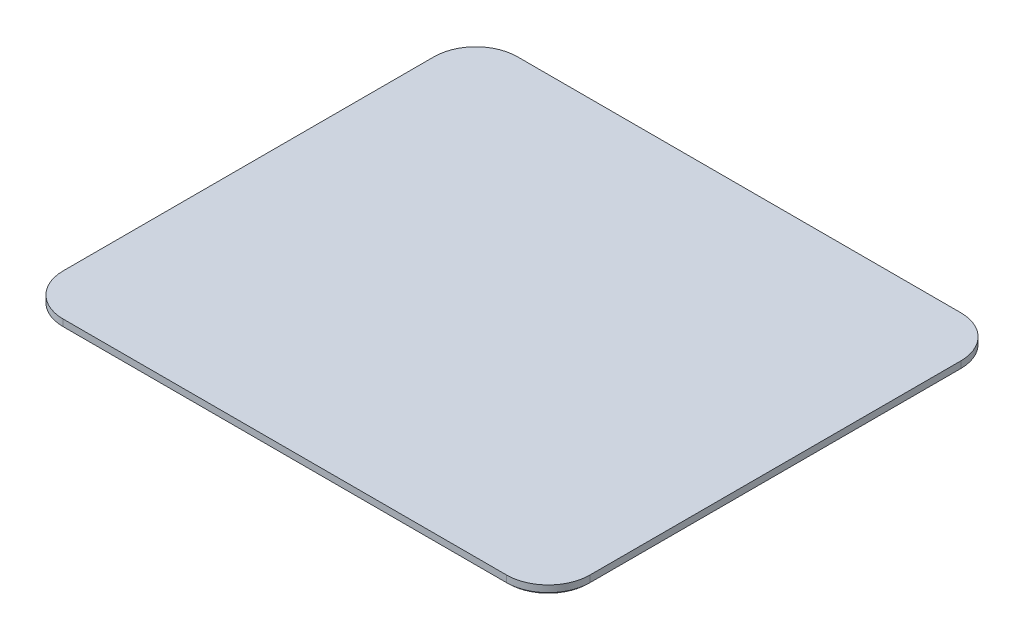
ISO-10303-21;
HEADER;
FILE_DESCRIPTION(('STEP AP214'),'2;1');
FILE_NAME('part.step','',(''),(''),'','','');
FILE_SCHEMA(('AUTOMOTIVE_DESIGN { 1 0 10303 214 1 1 1 1 }'));
ENDSEC;
DATA;
#1=APPLICATION_CONTEXT('core data for automotive mechanical design processes');
#2=APPLICATION_PROTOCOL_DEFINITION('international standard','automotive_design',2000,#1);
#3=PRODUCT_CONTEXT('',#1,'mechanical');
#4=PRODUCT('Part','Part','',(#3));
#5=PRODUCT_RELATED_PRODUCT_CATEGORY('part','',(#4));
#6=PRODUCT_DEFINITION_FORMATION('','',#4);
#7=PRODUCT_DEFINITION_CONTEXT('part definition',#1,'design');
#8=PRODUCT_DEFINITION('design','',#6,#7);
#9=PRODUCT_DEFINITION_SHAPE('','',#8);
#10=(LENGTH_UNIT() NAMED_UNIT(*) SI_UNIT(.MILLI.,.METRE.));
#11=(NAMED_UNIT(*) PLANE_ANGLE_UNIT() SI_UNIT($,.RADIAN.));
#12=(NAMED_UNIT(*) SI_UNIT($,.STERADIAN.) SOLID_ANGLE_UNIT());
#13=UNCERTAINTY_MEASURE_WITH_UNIT(LENGTH_MEASURE(1.E-05),#10,'distance_accuracy_value','');
#14=(GEOMETRIC_REPRESENTATION_CONTEXT(3) GLOBAL_UNCERTAINTY_ASSIGNED_CONTEXT((#13)) GLOBAL_UNIT_ASSIGNED_CONTEXT((#10,
#11,#12)) REPRESENTATION_CONTEXT('',''));
#15=CARTESIAN_POINT('',(0.,0.,0.));
#16=DIRECTION('',(0.,0.,1.));
#17=DIRECTION('',(1.,0.,0.));
#18=AXIS2_PLACEMENT_3D('',#15,#16,#17);
#19=CARTESIAN_POINT('',(-266.,-5.,222.5));
#20=DIRECTION('',(0.,1.,0.));
#21=DIRECTION('',(0.,0.,1.));
#22=AXIS2_PLACEMENT_3D('',#19,#20,#21);
#23=PLANE('',#22);
#24=DIRECTION('',(1.,0.,0.));
#25=VECTOR('',#24,1.);
#26=CARTESIAN_POINT('',(-266.,-5.,-262.5));
#27=LINE('',#26,#25);
#28=CARTESIAN_POINT('',(-100.,-5.,-262.5));
#29=VERTEX_POINT('',#28);
#30=CARTESIAN_POINT('',(100.,-5.,-262.5));
#31=VERTEX_POINT('',#30);
#32=EDGE_CURVE('E11',#29,#31,#27,.T.);
#33=ORIENTED_EDGE('',*,*,#32,.T.);
#34=DIRECTION('',(0.,0.,-1.));
#35=VECTOR('',#34,1.);
#36=CARTESIAN_POINT('',(100.,-5.,222.5));
#37=LINE('',#36,#35);
#38=CARTESIAN_POINT('',(100.,-4.99999999999997,-270.5));
#39=VERTEX_POINT('',#38);
#40=EDGE_CURVE('E288',#31,#39,#37,.T.);
#41=ORIENTED_EDGE('',*,*,#40,.T.);
#42=DIRECTION('',(1.,0.,0.));
#43=VECTOR('',#42,1.);
#44=CARTESIAN_POINT('',(-266.,-5.,-270.5));
#45=LINE('',#44,#43);
#46=CARTESIAN_POINT('',(266.,-5.,-270.5));
#47=VERTEX_POINT('',#46);
#48=EDGE_CURVE('E345',#39,#47,#45,.T.);
#49=ORIENTED_EDGE('',*,*,#48,.T.);
#50=CARTESIAN_POINT('',(266.,-5.,-222.5));
#51=DIRECTION('',(0.,1.,0.));
#52=DIRECTION('',(0.,0.,1.));
#53=AXIS2_PLACEMENT_3D('',#50,#51,#52);
#54=CIRCLE('',#53,48.);
#55=CARTESIAN_POINT('',(314.,-5.,-222.5));
#56=VERTEX_POINT('',#55);
#57=EDGE_CURVE('E349',#47,#56,#54,.F.);
#58=ORIENTED_EDGE('',*,*,#57,.T.);
#59=DIRECTION('',(0.,0.,1.));
#60=VECTOR('',#59,1.);
#61=CARTESIAN_POINT('',(314.,-5.,222.5));
#62=LINE('',#61,#60);
#63=CARTESIAN_POINT('',(314.,-5.,222.5));
#64=VERTEX_POINT('',#63);
#65=EDGE_CURVE('E351',#56,#64,#62,.T.);
#66=ORIENTED_EDGE('',*,*,#65,.T.);
#67=CARTESIAN_POINT('',(266.,-5.,222.5));
#68=DIRECTION('',(0.,1.,0.));
#69=DIRECTION('',(0.,0.,1.));
#70=AXIS2_PLACEMENT_3D('',#67,#68,#69);
#71=CIRCLE('',#70,48.);
#72=CARTESIAN_POINT('',(266.,-5.,270.5));
#73=VERTEX_POINT('',#72);
#74=EDGE_CURVE('E353',#64,#73,#71,.F.);
#75=ORIENTED_EDGE('',*,*,#74,.T.);
#76=DIRECTION('',(-1.,0.,0.));
#77=VECTOR('',#76,1.);
#78=CARTESIAN_POINT('',(-266.,-5.,270.5));
#79=LINE('',#78,#77);
#80=CARTESIAN_POINT('',(-266.,-5.,270.5));
#81=VERTEX_POINT('',#80);
#82=EDGE_CURVE('E337',#73,#81,#79,.T.);
#83=ORIENTED_EDGE('',*,*,#82,.T.);
#84=CARTESIAN_POINT('',(-266.,-5.,222.5));
#85=DIRECTION('',(0.,1.,0.));
#86=DIRECTION('',(0.,0.,1.));
#87=AXIS2_PLACEMENT_3D('',#84,#85,#86);
#88=CIRCLE('',#87,48.);
#89=CARTESIAN_POINT('',(-314.,-5.,222.5));
#90=VERTEX_POINT('',#89);
#91=EDGE_CURVE('E339',#81,#90,#88,.F.);
#92=ORIENTED_EDGE('',*,*,#91,.T.);
#93=DIRECTION('',(0.,0.,-1.));
#94=VECTOR('',#93,1.);
#95=CARTESIAN_POINT('',(-314.,-5.,222.5));
#96=LINE('',#95,#94);
#97=CARTESIAN_POINT('',(-314.,-5.,-222.5));
#98=VERTEX_POINT('',#97);
#99=EDGE_CURVE('E341',#90,#98,#96,.T.);
#100=ORIENTED_EDGE('',*,*,#99,.T.);
#101=CARTESIAN_POINT('',(-266.,-5.,-222.5));
#102=DIRECTION('',(0.,1.,0.));
#103=DIRECTION('',(0.,0.,1.));
#104=AXIS2_PLACEMENT_3D('',#101,#102,#103);
#105=CIRCLE('',#104,48.);
#106=CARTESIAN_POINT('',(-266.,-5.,-270.5));
#107=VERTEX_POINT('',#106);
#108=EDGE_CURVE('E343',#98,#107,#105,.F.);
#109=ORIENTED_EDGE('',*,*,#108,.T.);
#110=CARTESIAN_POINT('',(-100.,-4.99999999999997,-270.5));
#111=VERTEX_POINT('',#110);
#112=EDGE_CURVE('E346',#107,#111,#45,.T.);
#113=ORIENTED_EDGE('',*,*,#112,.T.);
#114=DIRECTION('',(0.,0.,1.));
#115=VECTOR('',#114,1.);
#116=CARTESIAN_POINT('',(-100.,-5.,222.5));
#117=LINE('',#116,#115);
#118=EDGE_CURVE('E280',#111,#29,#117,.T.);
#119=ORIENTED_EDGE('',*,*,#118,.T.);
#120=EDGE_LOOP('',(#33,#41,#49,#58,#66,#75,#83,#92,#100,#109,#113,#119));
#121=FACE_BOUND('',#120,.T.);
#122=CARTESIAN_POINT('',(-200.,-5.,150.));
#123=DIRECTION('',(0.,-1.,0.));
#124=DIRECTION('',(0.,0.,-1.));
#125=AXIS2_PLACEMENT_3D('',#122,#123,#124);
#126=CIRCLE('',#125,50.);
#127=CARTESIAN_POINT('',(-200.,-5.,200.));
#128=VERTEX_POINT('',#127);
#129=CARTESIAN_POINT('',(-250.,-5.,150.));
#130=VERTEX_POINT('',#129);
#131=EDGE_CURVE('E239',#128,#130,#126,.T.);
#132=ORIENTED_EDGE('',*,*,#131,.F.);
#133=DIRECTION('',(-1.,0.,0.));
#134=VECTOR('',#133,1.);
#135=CARTESIAN_POINT('',(-200.,-5.,200.));
#136=LINE('',#135,#134);
#137=CARTESIAN_POINT('',(200.,-5.,200.));
#138=VERTEX_POINT('',#137);
#139=EDGE_CURVE('E236',#138,#128,#136,.T.);
#140=ORIENTED_EDGE('',*,*,#139,.F.);
#141=CARTESIAN_POINT('',(200.,-5.,150.));
#142=DIRECTION('',(0.,-1.,0.));
#143=DIRECTION('',(0.,0.,-1.));
#144=AXIS2_PLACEMENT_3D('',#141,#142,#143);
#145=CIRCLE('',#144,50.);
#146=CARTESIAN_POINT('',(250.,-5.,150.));
#147=VERTEX_POINT('',#146);
#148=EDGE_CURVE('E783',#147,#138,#145,.T.);
#149=ORIENTED_EDGE('',*,*,#148,.F.);
#150=DIRECTION('',(0.,0.,1.));
#151=VECTOR('',#150,1.);
#152=CARTESIAN_POINT('',(250.,-5.,150.));
#153=LINE('',#152,#151);
#154=CARTESIAN_POINT('',(250.,-5.,-150.));
#155=VERTEX_POINT('',#154);
#156=EDGE_CURVE('E814',#155,#147,#153,.T.);
#157=ORIENTED_EDGE('',*,*,#156,.F.);
#158=CARTESIAN_POINT('',(200.,-5.,-150.));
#159=DIRECTION('',(0.,-1.,0.));
#160=DIRECTION('',(0.,0.,-1.));
#161=AXIS2_PLACEMENT_3D('',#158,#159,#160);
#162=CIRCLE('',#161,50.);
#163=CARTESIAN_POINT('',(200.,-5.,-200.));
#164=VERTEX_POINT('',#163);
#165=EDGE_CURVE('E807',#164,#155,#162,.T.);
#166=ORIENTED_EDGE('',*,*,#165,.F.);
#167=DIRECTION('',(1.,0.,0.));
#168=VECTOR('',#167,1.);
#169=CARTESIAN_POINT('',(-200.,-5.,-200.));
#170=LINE('',#169,#168);
#171=CARTESIAN_POINT('',(-200.,-5.,-200.));
#172=VERTEX_POINT('',#171);
#173=EDGE_CURVE('E804',#172,#164,#170,.T.);
#174=ORIENTED_EDGE('',*,*,#173,.F.);
#175=CARTESIAN_POINT('',(-200.,-5.,-150.));
#176=DIRECTION('',(0.,-1.,0.));
#177=DIRECTION('',(0.,0.,-1.));
#178=AXIS2_PLACEMENT_3D('',#175,#176,#177);
#179=CIRCLE('',#178,50.);
#180=CARTESIAN_POINT('',(-250.,-5.,-150.));
#181=VERTEX_POINT('',#180);
#182=EDGE_CURVE('E60',#181,#172,#179,.T.);
#183=ORIENTED_EDGE('',*,*,#182,.F.);
#184=DIRECTION('',(0.,0.,-1.));
#185=VECTOR('',#184,1.);
#186=CARTESIAN_POINT('',(-250.,-5.,150.));
#187=LINE('',#186,#185);
#188=EDGE_CURVE('E55',#130,#181,#187,.T.);
#189=ORIENTED_EDGE('',*,*,#188,.F.);
#190=EDGE_LOOP('',(#132,#140,#149,#157,#166,#174,#183,#189));
#191=FACE_BOUND('',#190,.T.);
#192=ADVANCED_FACE('F39',(#121,#191),#23,.F.);
#193=CARTESIAN_POINT('',(100.,-15.,-262.5));
#194=DIRECTION('',(1.,0.,0.));
#195=DIRECTION('',(0.,0.,-1.));
#196=AXIS2_PLACEMENT_3D('',#193,#194,#195);
#197=PLANE('',#196);
#198=CARTESIAN_POINT('',(100.,-9.99688936101096,-267.5));
#199=DIRECTION('',(1.,0.,0.));
#200=DIRECTION('',(0.,0.,-1.));
#201=AXIS2_PLACEMENT_3D('',#198,#199,#200);
#202=CIRCLE('',#201,5.);
#203=CARTESIAN_POINT('',(100.,-14.996889361011,-267.5));
#204=VERTEX_POINT('',#203);
#205=CARTESIAN_POINT('',(100.,-9.99688936101096,-262.5));
#206=VERTEX_POINT('',#205);
#207=EDGE_CURVE('E257',#204,#206,#202,.F.);
#208=ORIENTED_EDGE('',*,*,#207,.F.);
#209=DIRECTION('',(0.,1.,0.));
#210=VECTOR('',#209,1.);
#211=CARTESIAN_POINT('',(100.,-15.,-267.5));
#212=LINE('',#211,#210);
#213=CARTESIAN_POINT('',(100.,-15.,-267.5));
#214=VERTEX_POINT('',#213);
#215=EDGE_CURVE('E259',#214,#204,#212,.T.);
#216=ORIENTED_EDGE('',*,*,#215,.F.);
#217=DIRECTION('',(0.,0.,-1.));
#218=VECTOR('',#217,1.);
#219=CARTESIAN_POINT('',(100.,-15.,-262.5));
#220=LINE('',#219,#218);
#221=CARTESIAN_POINT('',(100.,-15.,-272.5));
#222=VERTEX_POINT('',#221);
#223=EDGE_CURVE('E269',#214,#222,#220,.T.);
#224=ORIENTED_EDGE('',*,*,#223,.T.);
#225=DIRECTION('',(0.,1.,0.));
#226=VECTOR('',#225,1.);
#227=CARTESIAN_POINT('',(100.,-15.,-272.5));
#228=LINE('',#227,#226);
#229=CARTESIAN_POINT('',(100.,-3.,-272.5));
#230=VERTEX_POINT('',#229);
#231=EDGE_CURVE('E277',#222,#230,#228,.T.);
#232=ORIENTED_EDGE('',*,*,#231,.T.);
#233=DIRECTION('',(0.,0.707106781186548,-0.707106781186548));
#234=VECTOR('',#233,1.);
#235=CARTESIAN_POINT('',(100.,-3.,-272.5));
#236=LINE('',#235,#234);
#237=EDGE_CURVE('E48',#230,#39,#236,.F.);
#238=ORIENTED_EDGE('',*,*,#237,.T.);
#239=ORIENTED_EDGE('',*,*,#40,.F.);
#240=DIRECTION('',(0.,1.,0.));
#241=VECTOR('',#240,1.);
#242=CARTESIAN_POINT('',(100.,-15.,-262.5));
#243=LINE('',#242,#241);
#244=EDGE_CURVE('E278',#206,#31,#243,.T.);
#245=ORIENTED_EDGE('',*,*,#244,.F.);
#246=EDGE_LOOP('',(#208,#216,#224,#232,#238,#239,#245));
#247=FACE_BOUND('',#246,.T.);
#248=CARTESIAN_POINT('',(100.,-9.99688936101096,-267.5));
#249=DIRECTION('',(1.,0.,0.));
#250=DIRECTION('',(0.,0.,-1.));
#251=AXIS2_PLACEMENT_3D('',#248,#249,#250);
#252=CIRCLE('',#251,2.);
#253=CARTESIAN_POINT('',(100.,-9.99688936101096,-269.5));
#254=VERTEX_POINT('',#253);
#255=EDGE_CURVE('E243',#254,#254,#252,.T.);
#256=ORIENTED_EDGE('',*,*,#255,.F.);
#257=EDGE_LOOP('',(#256));
#258=FACE_BOUND('',#257,.T.);
#259=ADVANCED_FACE('F398',(#247,#258),#197,.T.);
#260=CARTESIAN_POINT('',(-100.,-15.,-272.5));
#261=DIRECTION('',(-1.,0.,0.));
#262=DIRECTION('',(0.,0.,1.));
#263=AXIS2_PLACEMENT_3D('',#260,#261,#262);
#264=PLANE('',#263);
#265=DIRECTION('',(0.,0.,1.));
#266=VECTOR('',#265,1.);
#267=CARTESIAN_POINT('',(-100.,-15.,-272.5));
#268=LINE('',#267,#266);
#269=CARTESIAN_POINT('',(-100.,-15.,-272.5));
#270=VERTEX_POINT('',#269);
#271=CARTESIAN_POINT('',(-100.,-15.,-267.5));
#272=VERTEX_POINT('',#271);
#273=EDGE_CURVE('E274',#270,#272,#268,.T.);
#274=ORIENTED_EDGE('',*,*,#273,.T.);
#275=DIRECTION('',(0.,1.,0.));
#276=VECTOR('',#275,1.);
#277=CARTESIAN_POINT('',(-100.,-15.,-267.5));
#278=LINE('',#277,#276);
#279=CARTESIAN_POINT('',(-100.,-14.996889361011,-267.5));
#280=VERTEX_POINT('',#279);
#281=EDGE_CURVE('E254',#272,#280,#278,.T.);
#282=ORIENTED_EDGE('',*,*,#281,.T.);
#283=CARTESIAN_POINT('',(-100.,-9.99688936101096,-267.5));
#284=DIRECTION('',(-1.,0.,0.));
#285=DIRECTION('',(0.,0.,1.));
#286=AXIS2_PLACEMENT_3D('',#283,#284,#285);
#287=CIRCLE('',#286,5.);
#288=CARTESIAN_POINT('',(-100.,-9.99688936101096,-262.5));
#289=VERTEX_POINT('',#288);
#290=EDGE_CURVE('E251',#280,#289,#287,.T.);
#291=ORIENTED_EDGE('',*,*,#290,.T.);
#292=DIRECTION('',(0.,1.,0.));
#293=VECTOR('',#292,1.);
#294=CARTESIAN_POINT('',(-100.,-15.,-262.5));
#295=LINE('',#294,#293);
#296=EDGE_CURVE('E281',#289,#29,#295,.T.);
#297=ORIENTED_EDGE('',*,*,#296,.T.);
#298=ORIENTED_EDGE('',*,*,#118,.F.);
#299=DIRECTION('',(0.,-0.707106781186548,0.707106781186548));
#300=VECTOR('',#299,1.);
#301=CARTESIAN_POINT('',(-100.,-3.,-272.5));
#302=LINE('',#301,#300);
#303=CARTESIAN_POINT('',(-100.,-3.,-272.5));
#304=VERTEX_POINT('',#303);
#305=EDGE_CURVE('E372',#111,#304,#302,.F.);
#306=ORIENTED_EDGE('',*,*,#305,.T.);
#307=DIRECTION('',(0.,1.,0.));
#308=VECTOR('',#307,1.);
#309=CARTESIAN_POINT('',(-100.,-15.,-272.5));
#310=LINE('',#309,#308);
#311=EDGE_CURVE('E283',#270,#304,#310,.T.);
#312=ORIENTED_EDGE('',*,*,#311,.F.);
#313=EDGE_LOOP('',(#274,#282,#291,#297,#298,#306,#312));
#314=FACE_BOUND('',#313,.T.);
#315=CARTESIAN_POINT('',(-100.,-9.99688936101096,-267.5));
#316=DIRECTION('',(-1.,0.,0.));
#317=DIRECTION('',(0.,0.,1.));
#318=AXIS2_PLACEMENT_3D('',#315,#316,#317);
#319=CIRCLE('',#318,2.);
#320=CARTESIAN_POINT('',(-100.,-9.99688936101096,-265.5));
#321=VERTEX_POINT('',#320);
#322=EDGE_CURVE('E240',#321,#321,#319,.F.);
#323=ORIENTED_EDGE('',*,*,#322,.T.);
#324=EDGE_LOOP('',(#323));
#325=FACE_BOUND('',#324,.T.);
#326=ADVANCED_FACE('F466',(#314,#325),#264,.T.);
#327=CARTESIAN_POINT('',(0.,-15.,0.));
#328=DIRECTION('',(0.,-1.,0.));
#329=DIRECTION('',(0.,0.,-1.));
#330=AXIS2_PLACEMENT_3D('',#327,#328,#329);
#331=PLANE('',#330);
#332=ORIENTED_EDGE('',*,*,#223,.F.);
#333=DIRECTION('',(-1.,0.,0.));
#334=VECTOR('',#333,1.);
#335=CARTESIAN_POINT('',(316.001,-15.,-267.5));
#336=LINE('',#335,#334);
#337=EDGE_CURVE('E266',#214,#272,#336,.T.);
#338=ORIENTED_EDGE('',*,*,#337,.T.);
#339=ORIENTED_EDGE('',*,*,#273,.F.);
#340=DIRECTION('',(-1.,0.,0.));
#341=VECTOR('',#340,1.);
#342=CARTESIAN_POINT('',(-100.,-15.,-272.5));
#343=LINE('',#342,#341);
#344=EDGE_CURVE('E271',#222,#270,#343,.T.);
#345=ORIENTED_EDGE('',*,*,#344,.F.);
#346=EDGE_LOOP('',(#332,#338,#339,#345));
#347=FACE_BOUND('',#346,.T.);
#348=ADVANCED_FACE('F481',(#347),#331,.T.);
#349=CARTESIAN_POINT('',(-266.,-3.,-272.5));
#350=DIRECTION('',(0.,0.707106781186547,0.707106781186547));
#351=DIRECTION('',(-1.,0.,0.));
#352=AXIS2_PLACEMENT_3D('',#349,#350,#351);
#353=PLANE('',#352);
#354=ORIENTED_EDGE('',*,*,#237,.F.);
#355=DIRECTION('',(-1.,0.,0.));
#356=VECTOR('',#355,1.);
#357=CARTESIAN_POINT('',(-266.,-3.,-272.5));
#358=LINE('',#357,#356);
#359=CARTESIAN_POINT('',(266.,-3.,-272.5));
#360=VERTEX_POINT('',#359);
#361=EDGE_CURVE('E361',#360,#230,#358,.T.);
#362=ORIENTED_EDGE('',*,*,#361,.F.);
#363=DIRECTION('',(0.,0.707106781186547,-0.707106781186547));
#364=VECTOR('',#363,1.);
#365=CARTESIAN_POINT('',(266.,-5.,-270.5));
#366=LINE('',#365,#364);
#367=EDGE_CURVE('E382',#47,#360,#366,.T.);
#368=ORIENTED_EDGE('',*,*,#367,.F.);
#369=ORIENTED_EDGE('',*,*,#48,.F.);
#370=EDGE_LOOP('',(#354,#362,#368,#369));
#371=FACE_BOUND('',#370,.T.);
#372=ADVANCED_FACE('F408',(#371),#353,.F.);
#373=CARTESIAN_POINT('',(-266.,5.,222.5));
#374=DIRECTION('',(0.,-1.,0.));
#375=DIRECTION('',(0.,0.,-1.));
#376=AXIS2_PLACEMENT_3D('',#373,#374,#375);
#377=CYLINDRICAL_SURFACE('',#376,50.);
#378=DIRECTION('',(0.,-1.,0.));
#379=VECTOR('',#378,1.);
#380=CARTESIAN_POINT('',(-316.,5.,222.5));
#381=LINE('',#380,#379);
#382=CARTESIAN_POINT('',(-316.,5.,222.5));
#383=VERTEX_POINT('',#382);
#384=CARTESIAN_POINT('',(-316.,-3.,222.5));
#385=VERTEX_POINT('',#384);
#386=EDGE_CURVE('E310',#383,#385,#381,.T.);
#387=ORIENTED_EDGE('',*,*,#386,.T.);
#388=CARTESIAN_POINT('',(-266.,-3.,222.5));
#389=DIRECTION('',(0.,1.,0.));
#390=DIRECTION('',(0.,0.,1.));
#391=AXIS2_PLACEMENT_3D('',#388,#389,#390);
#392=CIRCLE('',#391,50.);
#393=CARTESIAN_POINT('',(-266.,-3.,272.5));
#394=VERTEX_POINT('',#393);
#395=EDGE_CURVE('E368',#385,#394,#392,.T.);
#396=ORIENTED_EDGE('',*,*,#395,.T.);
#397=DIRECTION('',(0.,-1.,0.));
#398=VECTOR('',#397,1.);
#399=CARTESIAN_POINT('',(-266.,5.,272.5));
#400=LINE('',#399,#398);
#401=CARTESIAN_POINT('',(-266.,5.,272.5));
#402=VERTEX_POINT('',#401);
#403=EDGE_CURVE('E331',#402,#394,#400,.T.);
#404=ORIENTED_EDGE('',*,*,#403,.F.);
#405=CARTESIAN_POINT('',(-266.,5.,222.5));
#406=DIRECTION('',(0.,1.,0.));
#407=DIRECTION('',(0.,0.,1.));
#408=AXIS2_PLACEMENT_3D('',#405,#406,#407);
#409=CIRCLE('',#408,50.);
#410=EDGE_CURVE('E292',#383,#402,#409,.T.);
#411=ORIENTED_EDGE('',*,*,#410,.F.);
#412=EDGE_LOOP('',(#387,#396,#404,#411));
#413=FACE_BOUND('',#412,.T.);
#414=ADVANCED_FACE('F519',(#413),#377,.T.);
#415=CARTESIAN_POINT('',(-266.,5.,272.5));
#416=DIRECTION('',(0.,0.,-1.));
#417=DIRECTION('',(-1.,0.,0.));
#418=AXIS2_PLACEMENT_3D('',#415,#416,#417);
#419=PLANE('',#418);
#420=ORIENTED_EDGE('',*,*,#403,.T.);
#421=DIRECTION('',(1.,0.,0.));
#422=VECTOR('',#421,1.);
#423=CARTESIAN_POINT('',(-266.,-3.,272.5));
#424=LINE('',#423,#422);
#425=CARTESIAN_POINT('',(266.,-3.,272.5));
#426=VERTEX_POINT('',#425);
#427=EDGE_CURVE('E370',#394,#426,#424,.T.);
#428=ORIENTED_EDGE('',*,*,#427,.T.);
#429=DIRECTION('',(0.,-1.,0.));
#430=VECTOR('',#429,1.);
#431=CARTESIAN_POINT('',(266.,5.,272.5));
#432=LINE('',#431,#430);
#433=CARTESIAN_POINT('',(266.,5.,272.5));
#434=VERTEX_POINT('',#433);
#435=EDGE_CURVE('E328',#434,#426,#432,.T.);
#436=ORIENTED_EDGE('',*,*,#435,.F.);
#437=DIRECTION('',(1.,0.,0.));
#438=VECTOR('',#437,1.);
#439=CARTESIAN_POINT('',(-266.,5.,272.5));
#440=LINE('',#439,#438);
#441=EDGE_CURVE('E295',#402,#434,#440,.T.);
#442=ORIENTED_EDGE('',*,*,#441,.F.);
#443=EDGE_LOOP('',(#420,#428,#436,#442));
#444=FACE_BOUND('',#443,.T.);
#445=ADVANCED_FACE('F441',(#444),#419,.F.);
#446=CARTESIAN_POINT('',(266.,5.,222.5));
#447=DIRECTION('',(0.,-1.,0.));
#448=DIRECTION('',(0.,0.,-1.));
#449=AXIS2_PLACEMENT_3D('',#446,#447,#448);
#450=CYLINDRICAL_SURFACE('',#449,50.);
#451=ORIENTED_EDGE('',*,*,#435,.T.);
#452=CARTESIAN_POINT('',(266.,-3.,222.5));
#453=DIRECTION('',(0.,1.,0.));
#454=DIRECTION('',(0.,0.,1.));
#455=AXIS2_PLACEMENT_3D('',#452,#453,#454);
#456=CIRCLE('',#455,50.);
#457=CARTESIAN_POINT('',(316.,-3.,222.5));
#458=VERTEX_POINT('',#457);
#459=EDGE_CURVE('E334',#426,#458,#456,.T.);
#460=ORIENTED_EDGE('',*,*,#459,.T.);
#461=DIRECTION('',(0.,-1.,0.));
#462=VECTOR('',#461,1.);
#463=CARTESIAN_POINT('',(316.,5.,222.5));
#464=LINE('',#463,#462);
#465=CARTESIAN_POINT('',(316.,5.,222.5));
#466=VERTEX_POINT('',#465);
#467=EDGE_CURVE('E325',#466,#458,#464,.T.);
#468=ORIENTED_EDGE('',*,*,#467,.F.);
#469=CARTESIAN_POINT('',(266.,5.,222.5));
#470=DIRECTION('',(0.,1.,0.));
#471=DIRECTION('',(0.,0.,1.));
#472=AXIS2_PLACEMENT_3D('',#469,#470,#471);
#473=CIRCLE('',#472,50.);
#474=EDGE_CURVE('E298',#434,#466,#473,.T.);
#475=ORIENTED_EDGE('',*,*,#474,.F.);
#476=EDGE_LOOP('',(#451,#460,#468,#475));
#477=FACE_BOUND('',#476,.T.);
#478=ADVANCED_FACE('F429',(#477),#450,.T.);
#479=CARTESIAN_POINT('',(316.,5.,-222.5));
#480=DIRECTION('',(-1.,0.,0.));
#481=DIRECTION('',(0.,0.,1.));
#482=AXIS2_PLACEMENT_3D('',#479,#480,#481);
#483=PLANE('',#482);
#484=ORIENTED_EDGE('',*,*,#467,.T.);
#485=DIRECTION('',(0.,0.,-1.));
#486=VECTOR('',#485,1.);
#487=CARTESIAN_POINT('',(316.,-3.,-222.5));
#488=LINE('',#487,#486);
#489=CARTESIAN_POINT('',(316.,-3.,-222.5));
#490=VERTEX_POINT('',#489);
#491=EDGE_CURVE('E356',#458,#490,#488,.T.);
#492=ORIENTED_EDGE('',*,*,#491,.T.);
#493=DIRECTION('',(0.,-1.,0.));
#494=VECTOR('',#493,1.);
#495=CARTESIAN_POINT('',(316.,5.,-222.5));
#496=LINE('',#495,#494);
#497=CARTESIAN_POINT('',(316.,5.,-222.5));
#498=VERTEX_POINT('',#497);
#499=EDGE_CURVE('E322',#498,#490,#496,.T.);
#500=ORIENTED_EDGE('',*,*,#499,.F.);
#501=DIRECTION('',(0.,0.,-1.));
#502=VECTOR('',#501,1.);
#503=CARTESIAN_POINT('',(316.,5.,-222.5));
#504=LINE('',#503,#502);
#505=EDGE_CURVE('E300',#466,#498,#504,.T.);
#506=ORIENTED_EDGE('',*,*,#505,.F.);
#507=EDGE_LOOP('',(#484,#492,#500,#506));
#508=FACE_BOUND('',#507,.T.);
#509=ADVANCED_FACE('F433',(#508),#483,.F.);
#510=CARTESIAN_POINT('',(266.,5.,-222.5));
#511=DIRECTION('',(0.,-1.,0.));
#512=DIRECTION('',(0.,0.,-1.));
#513=AXIS2_PLACEMENT_3D('',#510,#511,#512);
#514=CYLINDRICAL_SURFACE('',#513,50.);
#515=ORIENTED_EDGE('',*,*,#499,.T.);
#516=CARTESIAN_POINT('',(266.,-3.,-222.5));
#517=DIRECTION('',(0.,1.,0.));
#518=DIRECTION('',(0.,0.,1.));
#519=AXIS2_PLACEMENT_3D('',#516,#517,#518);
#520=CIRCLE('',#519,50.);
#521=EDGE_CURVE('E358',#490,#360,#520,.T.);
#522=ORIENTED_EDGE('',*,*,#521,.T.);
#523=DIRECTION('',(0.,-1.,0.));
#524=VECTOR('',#523,1.);
#525=CARTESIAN_POINT('',(266.,5.,-272.5));
#526=LINE('',#525,#524);
#527=CARTESIAN_POINT('',(266.,5.,-272.5));
#528=VERTEX_POINT('',#527);
#529=EDGE_CURVE('E319',#528,#360,#526,.T.);
#530=ORIENTED_EDGE('',*,*,#529,.F.);
#531=CARTESIAN_POINT('',(266.,5.,-222.5));
#532=DIRECTION('',(0.,1.,0.));
#533=DIRECTION('',(0.,0.,1.));
#534=AXIS2_PLACEMENT_3D('',#531,#532,#533);
#535=CIRCLE('',#534,50.);
#536=EDGE_CURVE('E302',#498,#528,#535,.T.);
#537=ORIENTED_EDGE('',*,*,#536,.F.);
#538=EDGE_LOOP('',(#515,#522,#530,#537));
#539=FACE_BOUND('',#538,.T.);
#540=ADVANCED_FACE('F488',(#539),#514,.T.);
#541=CARTESIAN_POINT('',(-266.,5.,-272.5));
#542=DIRECTION('',(0.,0.,1.));
#543=DIRECTION('',(1.,0.,0.));
#544=AXIS2_PLACEMENT_3D('',#541,#542,#543);
#545=PLANE('',#544);
#546=DIRECTION('',(0.,-1.,0.));
#547=VECTOR('',#546,1.);
#548=CARTESIAN_POINT('',(-266.,5.,-272.5));
#549=LINE('',#548,#547);
#550=CARTESIAN_POINT('',(-266.,5.,-272.5));
#551=VERTEX_POINT('',#550);
#552=CARTESIAN_POINT('',(-266.,-3.,-272.5));
#553=VERTEX_POINT('',#552);
#554=EDGE_CURVE('E316',#551,#553,#549,.T.);
#555=ORIENTED_EDGE('',*,*,#554,.F.);
#556=DIRECTION('',(-1.,0.,0.));
#557=VECTOR('',#556,1.);
#558=CARTESIAN_POINT('',(-266.,5.,-272.5));
#559=LINE('',#558,#557);
#560=EDGE_CURVE('E304',#528,#551,#559,.T.);
#561=ORIENTED_EDGE('',*,*,#560,.F.);
#562=ORIENTED_EDGE('',*,*,#529,.T.);
#563=ORIENTED_EDGE('',*,*,#361,.T.);
#564=ORIENTED_EDGE('',*,*,#231,.F.);
#565=ORIENTED_EDGE('',*,*,#344,.T.);
#566=ORIENTED_EDGE('',*,*,#311,.T.);
#567=EDGE_CURVE('E360',#304,#553,#358,.T.);
#568=ORIENTED_EDGE('',*,*,#567,.T.);
#569=EDGE_LOOP('',(#555,#561,#562,#563,#564,#565,#566,#568));
#570=FACE_BOUND('',#569,.T.);
#571=ADVANCED_FACE('F485',(#570),#545,.F.);
#572=CARTESIAN_POINT('',(-266.,5.,-222.5));
#573=DIRECTION('',(0.,-1.,0.));
#574=DIRECTION('',(0.,0.,-1.));
#575=AXIS2_PLACEMENT_3D('',#572,#573,#574);
#576=CYLINDRICAL_SURFACE('',#575,50.);
#577=ORIENTED_EDGE('',*,*,#554,.T.);
#578=CARTESIAN_POINT('',(-266.,-3.,-222.5));
#579=DIRECTION('',(0.,1.,0.));
#580=DIRECTION('',(0.,0.,1.));
#581=AXIS2_PLACEMENT_3D('',#578,#579,#580);
#582=CIRCLE('',#581,50.);
#583=CARTESIAN_POINT('',(-316.,-3.,-222.5));
#584=VERTEX_POINT('',#583);
#585=EDGE_CURVE('E364',#553,#584,#582,.T.);
#586=ORIENTED_EDGE('',*,*,#585,.T.);
#587=DIRECTION('',(0.,-1.,0.));
#588=VECTOR('',#587,1.);
#589=CARTESIAN_POINT('',(-316.,5.,-222.5));
#590=LINE('',#589,#588);
#591=CARTESIAN_POINT('',(-316.,5.,-222.5));
#592=VERTEX_POINT('',#591);
#593=EDGE_CURVE('E313',#592,#584,#590,.T.);
#594=ORIENTED_EDGE('',*,*,#593,.F.);
#595=CARTESIAN_POINT('',(-266.,5.,-222.5));
#596=DIRECTION('',(0.,1.,0.));
#597=DIRECTION('',(0.,0.,1.));
#598=AXIS2_PLACEMENT_3D('',#595,#596,#597);
#599=CIRCLE('',#598,50.);
#600=EDGE_CURVE('E306',#551,#592,#599,.T.);
#601=ORIENTED_EDGE('',*,*,#600,.F.);
#602=EDGE_LOOP('',(#577,#586,#594,#601));
#603=FACE_BOUND('',#602,.T.);
#604=ADVANCED_FACE('F495',(#603),#576,.T.);
#605=CARTESIAN_POINT('',(-316.,5.,-222.5));
#606=DIRECTION('',(1.,0.,0.));
#607=DIRECTION('',(0.,0.,-1.));
#608=AXIS2_PLACEMENT_3D('',#605,#606,#607);
#609=PLANE('',#608);
#610=ORIENTED_EDGE('',*,*,#593,.T.);
#611=DIRECTION('',(0.,0.,1.));
#612=VECTOR('',#611,1.);
#613=CARTESIAN_POINT('',(-316.,-3.,-222.5));
#614=LINE('',#613,#612);
#615=EDGE_CURVE('E366',#584,#385,#614,.T.);
#616=ORIENTED_EDGE('',*,*,#615,.T.);
#617=ORIENTED_EDGE('',*,*,#386,.F.);
#618=DIRECTION('',(0.,0.,1.));
#619=VECTOR('',#618,1.);
#620=CARTESIAN_POINT('',(-316.,5.,-222.5));
#621=LINE('',#620,#619);
#622=EDGE_CURVE('E308',#592,#383,#621,.T.);
#623=ORIENTED_EDGE('',*,*,#622,.F.);
#624=EDGE_LOOP('',(#610,#616,#617,#623));
#625=FACE_BOUND('',#624,.T.);
#626=ADVANCED_FACE('F506',(#625),#609,.F.);
#627=CARTESIAN_POINT('',(-266.,5.,222.5));
#628=DIRECTION('',(0.,1.,0.));
#629=DIRECTION('',(0.,0.,1.));
#630=AXIS2_PLACEMENT_3D('',#627,#628,#629);
#631=PLANE('',#630);
#632=ORIENTED_EDGE('',*,*,#560,.T.);
#633=ORIENTED_EDGE('',*,*,#600,.T.);
#634=ORIENTED_EDGE('',*,*,#622,.T.);
#635=ORIENTED_EDGE('',*,*,#410,.T.);
#636=ORIENTED_EDGE('',*,*,#441,.T.);
#637=ORIENTED_EDGE('',*,*,#474,.T.);
#638=ORIENTED_EDGE('',*,*,#505,.T.);
#639=ORIENTED_EDGE('',*,*,#536,.T.);
#640=EDGE_LOOP('',(#632,#633,#634,#635,#636,#637,#638,#639));
#641=FACE_BOUND('',#640,.T.);
#642=ADVANCED_FACE('F436',(#641),#631,.T.);
#643=CARTESIAN_POINT('',(-266.,-3.,-222.5));
#644=DIRECTION('',(0.,1.,0.));
#645=DIRECTION('',(0.,0.,1.));
#646=AXIS2_PLACEMENT_3D('',#643,#644,#645);
#647=CONICAL_SURFACE('',#646,50.,0.785398163397448);
#648=DIRECTION('',(0.,0.707106781186547,-0.707106781186547));
#649=VECTOR('',#648,1.);
#650=CARTESIAN_POINT('',(-266.,-5.,-270.5));
#651=LINE('',#650,#649);
#652=EDGE_CURVE('E388',#107,#553,#651,.T.);
#653=ORIENTED_EDGE('',*,*,#652,.F.);
#654=ORIENTED_EDGE('',*,*,#108,.F.);
#655=DIRECTION('',(0.707106781186547,-0.707106781186547,0.));
#656=VECTOR('',#655,1.);
#657=CARTESIAN_POINT('',(-316.,-3.,-222.5));
#658=LINE('',#657,#656);
#659=EDGE_CURVE('E296',#584,#98,#658,.T.);
#660=ORIENTED_EDGE('',*,*,#659,.F.);
#661=ORIENTED_EDGE('',*,*,#585,.F.);
#662=EDGE_LOOP('',(#653,#654,#660,#661));
#663=FACE_BOUND('',#662,.T.);
#664=ADVANCED_FACE('F42',(#663),#647,.T.);
#665=CARTESIAN_POINT('',(-316.,-3.,-222.5));
#666=DIRECTION('',(0.707106781186547,0.707106781186547,0.));
#667=DIRECTION('',(0.,0.,1.));
#668=AXIS2_PLACEMENT_3D('',#665,#666,#667);
#669=PLANE('',#668);
#670=ORIENTED_EDGE('',*,*,#659,.T.);
#671=ORIENTED_EDGE('',*,*,#99,.F.);
#672=DIRECTION('',(0.707106781186547,-0.707106781186547,0.));
#673=VECTOR('',#672,1.);
#674=CARTESIAN_POINT('',(-316.,-3.,222.5));
#675=LINE('',#674,#673);
#676=EDGE_CURVE('E385',#385,#90,#675,.T.);
#677=ORIENTED_EDGE('',*,*,#676,.F.);
#678=ORIENTED_EDGE('',*,*,#615,.F.);
#679=EDGE_LOOP('',(#670,#671,#677,#678));
#680=FACE_BOUND('',#679,.T.);
#681=ADVANCED_FACE('F454',(#680),#669,.F.);
#682=ORIENTED_EDGE('',*,*,#305,.F.);
#683=ORIENTED_EDGE('',*,*,#112,.F.);
#684=ORIENTED_EDGE('',*,*,#652,.T.);
#685=ORIENTED_EDGE('',*,*,#567,.F.);
#686=EDGE_LOOP('',(#682,#683,#684,#685));
#687=FACE_BOUND('',#686,.T.);
#688=ADVANCED_FACE('F464',(#687),#353,.F.);
#689=CARTESIAN_POINT('',(-266.,-3.,222.5));
#690=DIRECTION('',(0.,1.,0.));
#691=DIRECTION('',(0.,0.,1.));
#692=AXIS2_PLACEMENT_3D('',#689,#690,#691);
#693=CONICAL_SURFACE('',#692,50.,0.785398163397448);
#694=ORIENTED_EDGE('',*,*,#676,.T.);
#695=ORIENTED_EDGE('',*,*,#91,.F.);
#696=DIRECTION('',(0.,-0.707106781186547,-0.707106781186547));
#697=VECTOR('',#696,1.);
#698=CARTESIAN_POINT('',(-266.,-3.,272.5));
#699=LINE('',#698,#697);
#700=EDGE_CURVE('E379',#394,#81,#699,.T.);
#701=ORIENTED_EDGE('',*,*,#700,.F.);
#702=ORIENTED_EDGE('',*,*,#395,.F.);
#703=EDGE_LOOP('',(#694,#695,#701,#702));
#704=FACE_BOUND('',#703,.T.);
#705=ADVANCED_FACE('F449',(#704),#693,.T.);
#706=CARTESIAN_POINT('',(266.,-3.,-222.5));
#707=DIRECTION('',(0.,1.,0.));
#708=DIRECTION('',(0.,0.,1.));
#709=AXIS2_PLACEMENT_3D('',#706,#707,#708);
#710=CONICAL_SURFACE('',#709,50.,0.785398163397441);
#711=ORIENTED_EDGE('',*,*,#367,.T.);
#712=ORIENTED_EDGE('',*,*,#521,.F.);
#713=DIRECTION('',(0.707106781186538,0.707106781186557,0.));
#714=VECTOR('',#713,1.);
#715=CARTESIAN_POINT('',(314.,-5.,-222.5));
#716=LINE('',#715,#714);
#717=EDGE_CURVE('E376',#56,#490,#716,.T.);
#718=ORIENTED_EDGE('',*,*,#717,.F.);
#719=ORIENTED_EDGE('',*,*,#57,.F.);
#720=EDGE_LOOP('',(#711,#712,#718,#719));
#721=FACE_BOUND('',#720,.T.);
#722=ADVANCED_FACE('F413',(#721),#710,.T.);
#723=CARTESIAN_POINT('',(-266.,-3.,272.5));
#724=DIRECTION('',(0.,0.707106781186547,-0.707106781186547));
#725=DIRECTION('',(1.,0.,0.));
#726=AXIS2_PLACEMENT_3D('',#723,#724,#725);
#727=PLANE('',#726);
#728=ORIENTED_EDGE('',*,*,#700,.T.);
#729=ORIENTED_EDGE('',*,*,#82,.F.);
#730=DIRECTION('',(0.,-0.707106781186547,-0.707106781186547));
#731=VECTOR('',#730,1.);
#732=CARTESIAN_POINT('',(266.,-3.,272.5));
#733=LINE('',#732,#731);
#734=EDGE_CURVE('E374',#426,#73,#733,.T.);
#735=ORIENTED_EDGE('',*,*,#734,.F.);
#736=ORIENTED_EDGE('',*,*,#427,.F.);
#737=EDGE_LOOP('',(#728,#729,#735,#736));
#738=FACE_BOUND('',#737,.T.);
#739=ADVANCED_FACE('F445',(#738),#727,.F.);
#740=CARTESIAN_POINT('',(316.,-3.,-222.5));
#741=DIRECTION('',(-0.707106781186528,0.707106781186567,0.));
#742=DIRECTION('',(0.,0.,-1.));
#743=AXIS2_PLACEMENT_3D('',#740,#741,#742);
#744=PLANE('',#743);
#745=ORIENTED_EDGE('',*,*,#717,.T.);
#746=ORIENTED_EDGE('',*,*,#491,.F.);
#747=DIRECTION('',(0.707106781186567,0.707106781186528,0.));
#748=VECTOR('',#747,1.);
#749=CARTESIAN_POINT('',(314.,-5.,222.5));
#750=LINE('',#749,#748);
#751=EDGE_CURVE('E291',#64,#458,#750,.T.);
#752=ORIENTED_EDGE('',*,*,#751,.F.);
#753=ORIENTED_EDGE('',*,*,#65,.F.);
#754=EDGE_LOOP('',(#745,#746,#752,#753));
#755=FACE_BOUND('',#754,.T.);
#756=ADVANCED_FACE('F424',(#755),#744,.F.);
#757=CARTESIAN_POINT('',(266.,-3.,222.5));
#758=DIRECTION('',(0.,1.,0.));
#759=DIRECTION('',(0.,0.,1.));
#760=AXIS2_PLACEMENT_3D('',#757,#758,#759);
#761=CONICAL_SURFACE('',#760,50.,0.785398163397448);
#762=ORIENTED_EDGE('',*,*,#734,.T.);
#763=ORIENTED_EDGE('',*,*,#74,.F.);
#764=ORIENTED_EDGE('',*,*,#751,.T.);
#765=ORIENTED_EDGE('',*,*,#459,.F.);
#766=EDGE_LOOP('',(#762,#763,#764,#765));
#767=FACE_BOUND('',#766,.T.);
#768=ADVANCED_FACE('F419',(#767),#761,.T.);
#769=CARTESIAN_POINT('',(-100.,-15.,-262.5));
#770=DIRECTION('',(0.,0.,1.));
#771=DIRECTION('',(1.,0.,0.));
#772=AXIS2_PLACEMENT_3D('',#769,#770,#771);
#773=PLANE('',#772);
#774=DIRECTION('',(-1.,0.,0.));
#775=VECTOR('',#774,1.);
#776=CARTESIAN_POINT('',(316.001,-9.99688936101096,-262.5));
#777=LINE('',#776,#775);
#778=EDGE_CURVE('E262',#206,#289,#777,.T.);
#779=ORIENTED_EDGE('',*,*,#778,.F.);
#780=ORIENTED_EDGE('',*,*,#244,.T.);
#781=ORIENTED_EDGE('',*,*,#32,.F.);
#782=ORIENTED_EDGE('',*,*,#296,.F.);
#783=EDGE_LOOP('',(#779,#780,#781,#782));
#784=FACE_BOUND('',#783,.T.);
#785=ADVANCED_FACE('F472',(#784),#773,.T.);
#786=CARTESIAN_POINT('',(316.001,-15.,-267.5));
#787=DIRECTION('',(0.,0.,1.));
#788=DIRECTION('',(1.,0.,0.));
#789=AXIS2_PLACEMENT_3D('',#786,#787,#788);
#790=PLANE('',#789);
#791=ORIENTED_EDGE('',*,*,#215,.T.);
#792=DIRECTION('',(-1.,0.,0.));
#793=VECTOR('',#792,1.);
#794=CARTESIAN_POINT('',(316.001,-14.996889361011,-267.5));
#795=LINE('',#794,#793);
#796=EDGE_CURVE('E264',#204,#280,#795,.T.);
#797=ORIENTED_EDGE('',*,*,#796,.T.);
#798=ORIENTED_EDGE('',*,*,#281,.F.);
#799=ORIENTED_EDGE('',*,*,#337,.F.);
#800=EDGE_LOOP('',(#791,#797,#798,#799));
#801=FACE_BOUND('',#800,.T.);
#802=ADVANCED_FACE('F478',(#801),#790,.T.);
#803=CARTESIAN_POINT('',(316.001,-9.99688936101096,-267.5));
#804=DIRECTION('',(-1.,0.,0.));
#805=DIRECTION('',(0.,0.,1.));
#806=AXIS2_PLACEMENT_3D('',#803,#804,#805);
#807=CYLINDRICAL_SURFACE('',#806,5.);
#808=ORIENTED_EDGE('',*,*,#207,.T.);
#809=ORIENTED_EDGE('',*,*,#778,.T.);
#810=ORIENTED_EDGE('',*,*,#290,.F.);
#811=ORIENTED_EDGE('',*,*,#796,.F.);
#812=EDGE_LOOP('',(#808,#809,#810,#811));
#813=FACE_BOUND('',#812,.T.);
#814=ADVANCED_FACE('F476',(#813),#807,.T.);
#815=CARTESIAN_POINT('',(316.001,-9.99688936101096,-267.5));
#816=DIRECTION('',(-1.,0.,0.));
#817=DIRECTION('',(0.,0.,1.));
#818=AXIS2_PLACEMENT_3D('',#815,#816,#817);
#819=CYLINDRICAL_SURFACE('',#818,2.);
#820=ORIENTED_EDGE('',*,*,#255,.T.);
#821=EDGE_LOOP('',(#820));
#822=FACE_BOUND('',#821,.T.);
#823=ORIENTED_EDGE('',*,*,#322,.F.);
#824=EDGE_LOOP('',(#823));
#825=FACE_BOUND('',#824,.T.);
#826=ADVANCED_FACE('F675',(#822,#825),#819,.F.);
#827=CARTESIAN_POINT('',(-200.,-10.,150.));
#828=DIRECTION('',(0.,1.,0.));
#829=DIRECTION('',(0.,0.,1.));
#830=AXIS2_PLACEMENT_3D('',#827,#828,#829);
#831=CYLINDRICAL_SURFACE('',#830,50.);
#832=ORIENTED_EDGE('',*,*,#131,.T.);
#833=DIRECTION('',(0.,1.,0.));
#834=VECTOR('',#833,1.);
#835=CARTESIAN_POINT('',(-250.,-10.,150.));
#836=LINE('',#835,#834);
#837=CARTESIAN_POINT('',(-250.,-10.,150.));
#838=VERTEX_POINT('',#837);
#839=EDGE_CURVE('E220',#838,#130,#836,.T.);
#840=ORIENTED_EDGE('',*,*,#839,.F.);
#841=CARTESIAN_POINT('',(-200.,-10.,150.));
#842=DIRECTION('',(0.,-1.,0.));
#843=DIRECTION('',(0.,0.,-1.));
#844=AXIS2_PLACEMENT_3D('',#841,#842,#843);
#845=CIRCLE('',#844,50.);
#846=CARTESIAN_POINT('',(-200.,-10.,200.));
#847=VERTEX_POINT('',#846);
#848=EDGE_CURVE('E227',#847,#838,#845,.T.);
#849=ORIENTED_EDGE('',*,*,#848,.F.);
#850=DIRECTION('',(0.,1.,0.));
#851=VECTOR('',#850,1.);
#852=CARTESIAN_POINT('',(-200.,-10.,200.));
#853=LINE('',#852,#851);
#854=EDGE_CURVE('E779',#847,#128,#853,.T.);
#855=ORIENTED_EDGE('',*,*,#854,.T.);
#856=EDGE_LOOP('',(#832,#840,#849,#855));
#857=FACE_BOUND('',#856,.T.);
#858=ADVANCED_FACE('F238',(#857),#831,.T.);
#859=CARTESIAN_POINT('',(-250.,-10.,150.));
#860=DIRECTION('',(1.,0.,0.));
#861=DIRECTION('',(0.,0.,-1.));
#862=AXIS2_PLACEMENT_3D('',#859,#860,#861);
#863=PLANE('',#862);
#864=ORIENTED_EDGE('',*,*,#188,.T.);
#865=DIRECTION('',(0.,1.,0.));
#866=VECTOR('',#865,1.);
#867=CARTESIAN_POINT('',(-250.,-10.,-150.));
#868=LINE('',#867,#866);
#869=CARTESIAN_POINT('',(-250.,-10.,-150.));
#870=VERTEX_POINT('',#869);
#871=EDGE_CURVE('E223',#870,#181,#868,.T.);
#872=ORIENTED_EDGE('',*,*,#871,.F.);
#873=DIRECTION('',(0.,0.,-1.));
#874=VECTOR('',#873,1.);
#875=CARTESIAN_POINT('',(-250.,-10.,150.));
#876=LINE('',#875,#874);
#877=EDGE_CURVE('E216',#838,#870,#876,.T.);
#878=ORIENTED_EDGE('',*,*,#877,.F.);
#879=ORIENTED_EDGE('',*,*,#839,.T.);
#880=EDGE_LOOP('',(#864,#872,#878,#879));
#881=FACE_BOUND('',#880,.T.);
#882=ADVANCED_FACE('F218',(#881),#863,.F.);
#883=CARTESIAN_POINT('',(-200.,-10.,-150.));
#884=DIRECTION('',(0.,1.,0.));
#885=DIRECTION('',(0.,0.,1.));
#886=AXIS2_PLACEMENT_3D('',#883,#884,#885);
#887=CYLINDRICAL_SURFACE('',#886,50.);
#888=ORIENTED_EDGE('',*,*,#182,.T.);
#889=DIRECTION('',(0.,1.,0.));
#890=VECTOR('',#889,1.);
#891=CARTESIAN_POINT('',(-200.,-10.,-200.));
#892=LINE('',#891,#890);
#893=CARTESIAN_POINT('',(-200.,-10.,-200.));
#894=VERTEX_POINT('',#893);
#895=EDGE_CURVE('E245',#894,#172,#892,.T.);
#896=ORIENTED_EDGE('',*,*,#895,.F.);
#897=CARTESIAN_POINT('',(-200.,-10.,-150.));
#898=DIRECTION('',(0.,-1.,0.));
#899=DIRECTION('',(0.,0.,-1.));
#900=AXIS2_PLACEMENT_3D('',#897,#898,#899);
#901=CIRCLE('',#900,50.);
#902=EDGE_CURVE('E226',#870,#894,#901,.T.);
#903=ORIENTED_EDGE('',*,*,#902,.F.);
#904=ORIENTED_EDGE('',*,*,#871,.T.);
#905=EDGE_LOOP('',(#888,#896,#903,#904));
#906=FACE_BOUND('',#905,.T.);
#907=ADVANCED_FACE('F702',(#906),#887,.T.);
#908=CARTESIAN_POINT('',(-200.,-10.,-200.));
#909=DIRECTION('',(0.,0.,1.));
#910=DIRECTION('',(1.,0.,0.));
#911=AXIS2_PLACEMENT_3D('',#908,#909,#910);
#912=PLANE('',#911);
#913=ORIENTED_EDGE('',*,*,#173,.T.);
#914=DIRECTION('',(0.,1.,0.));
#915=VECTOR('',#914,1.);
#916=CARTESIAN_POINT('',(200.,-10.,-200.));
#917=LINE('',#916,#915);
#918=CARTESIAN_POINT('',(200.,-10.,-200.));
#919=VERTEX_POINT('',#918);
#920=EDGE_CURVE('E797',#919,#164,#917,.T.);
#921=ORIENTED_EDGE('',*,*,#920,.F.);
#922=DIRECTION('',(1.,0.,0.));
#923=VECTOR('',#922,1.);
#924=CARTESIAN_POINT('',(-200.,-10.,-200.));
#925=LINE('',#924,#923);
#926=EDGE_CURVE('E805',#894,#919,#925,.T.);
#927=ORIENTED_EDGE('',*,*,#926,.F.);
#928=ORIENTED_EDGE('',*,*,#895,.T.);
#929=EDGE_LOOP('',(#913,#921,#927,#928));
#930=FACE_BOUND('',#929,.T.);
#931=ADVANCED_FACE('F710',(#930),#912,.F.);
#932=CARTESIAN_POINT('',(200.,-10.,-150.));
#933=DIRECTION('',(0.,1.,0.));
#934=DIRECTION('',(0.,0.,1.));
#935=AXIS2_PLACEMENT_3D('',#932,#933,#934);
#936=CYLINDRICAL_SURFACE('',#935,50.);
#937=ORIENTED_EDGE('',*,*,#165,.T.);
#938=DIRECTION('',(0.,1.,0.));
#939=VECTOR('',#938,1.);
#940=CARTESIAN_POINT('',(250.,-10.,-150.));
#941=LINE('',#940,#939);
#942=CARTESIAN_POINT('',(250.,-10.,-150.));
#943=VERTEX_POINT('',#942);
#944=EDGE_CURVE('E794',#943,#155,#941,.T.);
#945=ORIENTED_EDGE('',*,*,#944,.F.);
#946=CARTESIAN_POINT('',(200.,-10.,-150.));
#947=DIRECTION('',(0.,-1.,0.));
#948=DIRECTION('',(0.,0.,-1.));
#949=AXIS2_PLACEMENT_3D('',#946,#947,#948);
#950=CIRCLE('',#949,50.);
#951=EDGE_CURVE('E822',#919,#943,#950,.T.);
#952=ORIENTED_EDGE('',*,*,#951,.F.);
#953=ORIENTED_EDGE('',*,*,#920,.T.);
#954=EDGE_LOOP('',(#937,#945,#952,#953));
#955=FACE_BOUND('',#954,.T.);
#956=ADVANCED_FACE('F719',(#955),#936,.T.);
#957=CARTESIAN_POINT('',(250.,-10.,150.));
#958=DIRECTION('',(-1.,0.,0.));
#959=DIRECTION('',(0.,0.,1.));
#960=AXIS2_PLACEMENT_3D('',#957,#958,#959);
#961=PLANE('',#960);
#962=ORIENTED_EDGE('',*,*,#156,.T.);
#963=DIRECTION('',(0.,1.,0.));
#964=VECTOR('',#963,1.);
#965=CARTESIAN_POINT('',(250.,-10.,150.));
#966=LINE('',#965,#964);
#967=CARTESIAN_POINT('',(250.,-10.,150.));
#968=VERTEX_POINT('',#967);
#969=EDGE_CURVE('E786',#968,#147,#966,.T.);
#970=ORIENTED_EDGE('',*,*,#969,.F.);
#971=DIRECTION('',(0.,0.,1.));
#972=VECTOR('',#971,1.);
#973=CARTESIAN_POINT('',(250.,-10.,150.));
#974=LINE('',#973,#972);
#975=EDGE_CURVE('E820',#943,#968,#974,.T.);
#976=ORIENTED_EDGE('',*,*,#975,.F.);
#977=ORIENTED_EDGE('',*,*,#944,.T.);
#978=EDGE_LOOP('',(#962,#970,#976,#977));
#979=FACE_BOUND('',#978,.T.);
#980=ADVANCED_FACE('F728',(#979),#961,.F.);
#981=CARTESIAN_POINT('',(200.,-10.,150.));
#982=DIRECTION('',(0.,1.,0.));
#983=DIRECTION('',(0.,0.,1.));
#984=AXIS2_PLACEMENT_3D('',#981,#982,#983);
#985=CYLINDRICAL_SURFACE('',#984,50.);
#986=ORIENTED_EDGE('',*,*,#148,.T.);
#987=DIRECTION('',(0.,1.,0.));
#988=VECTOR('',#987,1.);
#989=CARTESIAN_POINT('',(200.,-10.,200.));
#990=LINE('',#989,#988);
#991=CARTESIAN_POINT('',(200.,-10.,200.));
#992=VERTEX_POINT('',#991);
#993=EDGE_CURVE('E781',#992,#138,#990,.T.);
#994=ORIENTED_EDGE('',*,*,#993,.F.);
#995=CARTESIAN_POINT('',(200.,-10.,150.));
#996=DIRECTION('',(0.,-1.,0.));
#997=DIRECTION('',(0.,0.,-1.));
#998=AXIS2_PLACEMENT_3D('',#995,#996,#997);
#999=CIRCLE('',#998,50.);
#1000=EDGE_CURVE('E788',#968,#992,#999,.T.);
#1001=ORIENTED_EDGE('',*,*,#1000,.F.);
#1002=ORIENTED_EDGE('',*,*,#969,.T.);
#1003=EDGE_LOOP('',(#986,#994,#1001,#1002));
#1004=FACE_BOUND('',#1003,.T.);
#1005=ADVANCED_FACE('F737',(#1004),#985,.T.);
#1006=CARTESIAN_POINT('',(-200.,-10.,200.));
#1007=DIRECTION('',(0.,0.,-1.));
#1008=DIRECTION('',(-1.,0.,0.));
#1009=AXIS2_PLACEMENT_3D('',#1006,#1007,#1008);
#1010=PLANE('',#1009);
#1011=ORIENTED_EDGE('',*,*,#139,.T.);
#1012=ORIENTED_EDGE('',*,*,#854,.F.);
#1013=DIRECTION('',(-1.,0.,0.));
#1014=VECTOR('',#1013,1.);
#1015=CARTESIAN_POINT('',(-200.,-10.,200.));
#1016=LINE('',#1015,#1014);
#1017=EDGE_CURVE('E232',#992,#847,#1016,.T.);
#1018=ORIENTED_EDGE('',*,*,#1017,.F.);
#1019=ORIENTED_EDGE('',*,*,#993,.T.);
#1020=EDGE_LOOP('',(#1011,#1012,#1018,#1019));
#1021=FACE_BOUND('',#1020,.T.);
#1022=ADVANCED_FACE('F746',(#1021),#1010,.F.);
#1023=CARTESIAN_POINT('',(-200.,-10.,150.));
#1024=DIRECTION('',(0.,-1.,0.));
#1025=DIRECTION('',(0.,0.,-1.));
#1026=AXIS2_PLACEMENT_3D('',#1023,#1024,#1025);
#1027=PLANE('',#1026);
#1028=ORIENTED_EDGE('',*,*,#848,.T.);
#1029=ORIENTED_EDGE('',*,*,#877,.T.);
#1030=ORIENTED_EDGE('',*,*,#902,.T.);
#1031=ORIENTED_EDGE('',*,*,#926,.T.);
#1032=ORIENTED_EDGE('',*,*,#951,.T.);
#1033=ORIENTED_EDGE('',*,*,#975,.T.);
#1034=ORIENTED_EDGE('',*,*,#1000,.T.);
#1035=ORIENTED_EDGE('',*,*,#1017,.T.);
#1036=EDGE_LOOP('',(#1028,#1029,#1030,#1031,#1032,#1033,#1034,#1035));
#1037=FACE_BOUND('',#1036,.T.);
#1038=ADVANCED_FACE('F230',(#1037),#1027,.T.);
#1039=CLOSED_SHELL('',(#192,#259,#326,#348,#372,#414,#445,#478,#509,#540,#571,#604,#626,#642,
#664,#681,#688,#705,#722,#739,#756,#768,#785,#802,#814,#826,#858,#882,#907,#931,#956,#980,#1005,
#1022,#1038));
#1040=MANIFOLD_SOLID_BREP('B2',#1039);
#1041=ADVANCED_BREP_SHAPE_REPRESENTATION('',(#18,#1040),#14);
#1042=SHAPE_DEFINITION_REPRESENTATION(#9,#1041);
ENDSEC;
END-ISO-10303-21;
